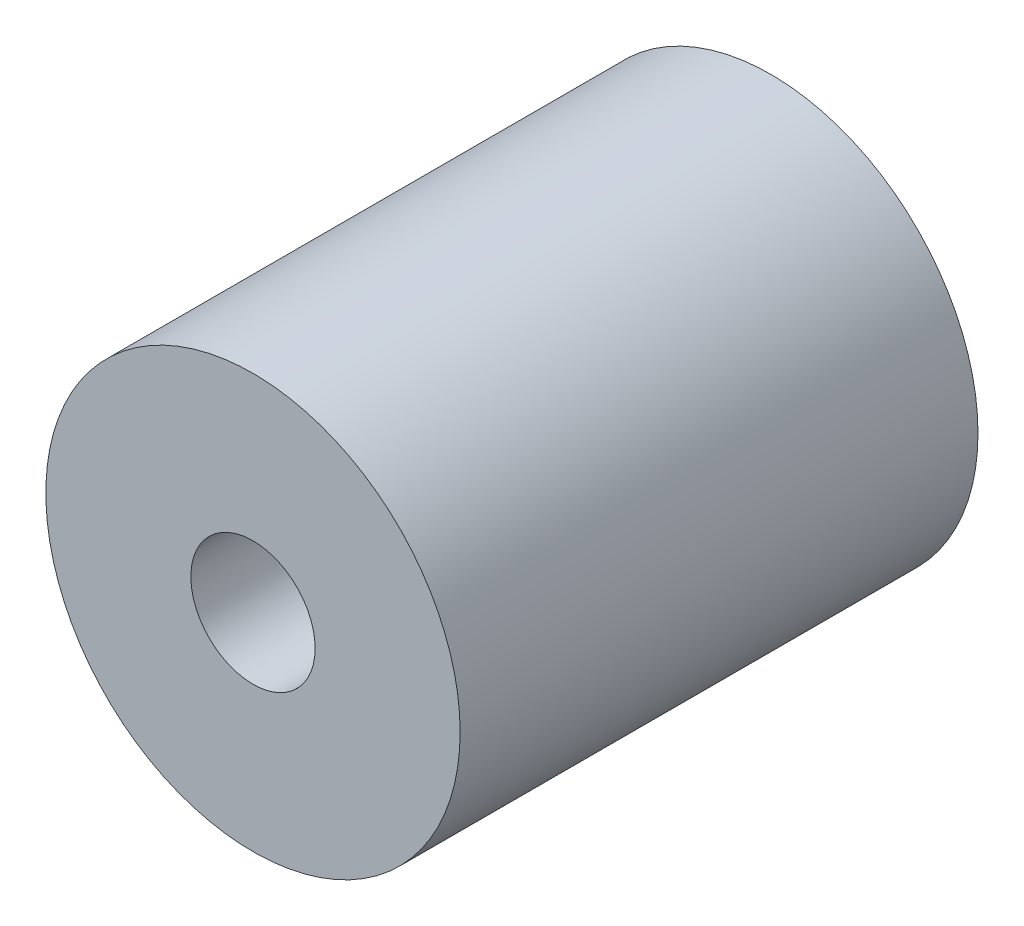
ISO-10303-21;
HEADER;
FILE_DESCRIPTION(('STEP AP214'),'2;1');
FILE_NAME('part.step','',(''),(''),'','','');
FILE_SCHEMA(('AUTOMOTIVE_DESIGN { 1 0 10303 214 1 1 1 1 }'));
ENDSEC;
DATA;
#1=APPLICATION_CONTEXT('core data for automotive mechanical design processes');
#2=APPLICATION_PROTOCOL_DEFINITION('international standard','automotive_design',2000,#1);
#3=PRODUCT_CONTEXT('',#1,'mechanical');
#4=PRODUCT('Part','Part','',(#3));
#5=PRODUCT_RELATED_PRODUCT_CATEGORY('part','',(#4));
#6=PRODUCT_DEFINITION_FORMATION('','',#4);
#7=PRODUCT_DEFINITION_CONTEXT('part definition',#1,'design');
#8=PRODUCT_DEFINITION('design','',#6,#7);
#9=PRODUCT_DEFINITION_SHAPE('','',#8);
#10=(LENGTH_UNIT() NAMED_UNIT(*) SI_UNIT(.MILLI.,.METRE.));
#11=(NAMED_UNIT(*) PLANE_ANGLE_UNIT() SI_UNIT($,.RADIAN.));
#12=(NAMED_UNIT(*) SI_UNIT($,.STERADIAN.) SOLID_ANGLE_UNIT());
#13=UNCERTAINTY_MEASURE_WITH_UNIT(LENGTH_MEASURE(1.E-05),#10,'distance_accuracy_value','');
#14=(GEOMETRIC_REPRESENTATION_CONTEXT(3) GLOBAL_UNCERTAINTY_ASSIGNED_CONTEXT((#13)) GLOBAL_UNIT_ASSIGNED_CONTEXT((#10,
#11,#12)) REPRESENTATION_CONTEXT('',''));
#15=CARTESIAN_POINT('',(0.,0.,0.));
#16=DIRECTION('',(0.,0.,1.));
#17=DIRECTION('',(1.,0.,0.));
#18=AXIS2_PLACEMENT_3D('',#15,#16,#17);
#19=CARTESIAN_POINT('',(0.,0.,25.));
#20=DIRECTION('',(0.,0.,1.));
#21=DIRECTION('',(1.,0.,0.));
#22=AXIS2_PLACEMENT_3D('',#19,#20,#21);
#23=PLANE('',#22);
#24=CARTESIAN_POINT('',(0.,0.,25.));
#25=DIRECTION('',(0.,0.,1.));
#26=DIRECTION('',(1.,0.,0.));
#27=AXIS2_PLACEMENT_3D('',#24,#25,#26);
#28=CIRCLE('',#27,10.);
#29=CARTESIAN_POINT('',(10.,0.,25.));
#30=VERTEX_POINT('',#29);
#31=EDGE_CURVE('E10',#30,#30,#28,.T.);
#32=ORIENTED_EDGE('',*,*,#31,.T.);
#33=EDGE_LOOP('',(#32));
#34=FACE_BOUND('',#33,.T.);
#35=CARTESIAN_POINT('',(0.,0.,25.));
#36=DIRECTION('',(0.,0.,1.));
#37=DIRECTION('',(1.,0.,0.));
#38=AXIS2_PLACEMENT_3D('',#35,#36,#37);
#39=CIRCLE('',#38,3.);
#40=CARTESIAN_POINT('',(3.,0.,25.));
#41=VERTEX_POINT('',#40);
#42=EDGE_CURVE('E42',#41,#41,#39,.T.);
#43=ORIENTED_EDGE('',*,*,#42,.F.);
#44=EDGE_LOOP('',(#43));
#45=FACE_BOUND('',#44,.T.);
#46=ADVANCED_FACE('F31',(#34,#45),#23,.T.);
#47=CARTESIAN_POINT('',(0.,0.,0.));
#48=DIRECTION('',(0.,0.,1.));
#49=DIRECTION('',(1.,0.,0.));
#50=AXIS2_PLACEMENT_3D('',#47,#48,#49);
#51=PLANE('',#50);
#52=CARTESIAN_POINT('',(0.,0.,0.));
#53=DIRECTION('',(0.,0.,1.));
#54=DIRECTION('',(1.,0.,0.));
#55=AXIS2_PLACEMENT_3D('',#52,#53,#54);
#56=CIRCLE('',#55,10.);
#57=CARTESIAN_POINT('',(10.,0.,0.));
#58=VERTEX_POINT('',#57);
#59=EDGE_CURVE('E35',#58,#58,#56,.T.);
#60=ORIENTED_EDGE('',*,*,#59,.F.);
#61=EDGE_LOOP('',(#60));
#62=FACE_BOUND('',#61,.T.);
#63=CARTESIAN_POINT('',(0.,0.,0.));
#64=DIRECTION('',(0.,0.,1.));
#65=DIRECTION('',(1.,0.,0.));
#66=AXIS2_PLACEMENT_3D('',#63,#64,#65);
#67=CIRCLE('',#66,3.);
#68=CARTESIAN_POINT('',(3.,0.,0.));
#69=VERTEX_POINT('',#68);
#70=EDGE_CURVE('E44',#69,#69,#67,.T.);
#71=ORIENTED_EDGE('',*,*,#70,.T.);
#72=EDGE_LOOP('',(#71));
#73=FACE_BOUND('',#72,.T.);
#74=ADVANCED_FACE('F54',(#62,#73),#51,.F.);
#75=CARTESIAN_POINT('',(0.,0.,25.));
#76=DIRECTION('',(0.,0.,-1.));
#77=DIRECTION('',(-1.,0.,0.));
#78=AXIS2_PLACEMENT_3D('',#75,#76,#77);
#79=CYLINDRICAL_SURFACE('',#78,10.);
#80=ORIENTED_EDGE('',*,*,#31,.F.);
#81=EDGE_LOOP('',(#80));
#82=FACE_BOUND('',#81,.T.);
#83=ORIENTED_EDGE('',*,*,#59,.T.);
#84=EDGE_LOOP('',(#83));
#85=FACE_BOUND('',#84,.T.);
#86=ADVANCED_FACE('F33',(#82,#85),#79,.T.);
#87=CARTESIAN_POINT('',(0.,0.,25.));
#88=DIRECTION('',(0.,0.,-1.));
#89=DIRECTION('',(-1.,0.,0.));
#90=AXIS2_PLACEMENT_3D('',#87,#88,#89);
#91=CYLINDRICAL_SURFACE('',#90,3.);
#92=ORIENTED_EDGE('',*,*,#42,.T.);
#93=EDGE_LOOP('',(#92));
#94=FACE_BOUND('',#93,.T.);
#95=ORIENTED_EDGE('',*,*,#70,.F.);
#96=EDGE_LOOP('',(#95));
#97=FACE_BOUND('',#96,.T.);
#98=ADVANCED_FACE('F50',(#94,#97),#91,.F.);
#99=CLOSED_SHELL('',(#46,#74,#86,#98));
#100=MANIFOLD_SOLID_BREP('B2',#99);
#101=ADVANCED_BREP_SHAPE_REPRESENTATION('',(#18,#100),#14);
#102=SHAPE_DEFINITION_REPRESENTATION(#9,#101);
ENDSEC;
END-ISO-10303-21;
